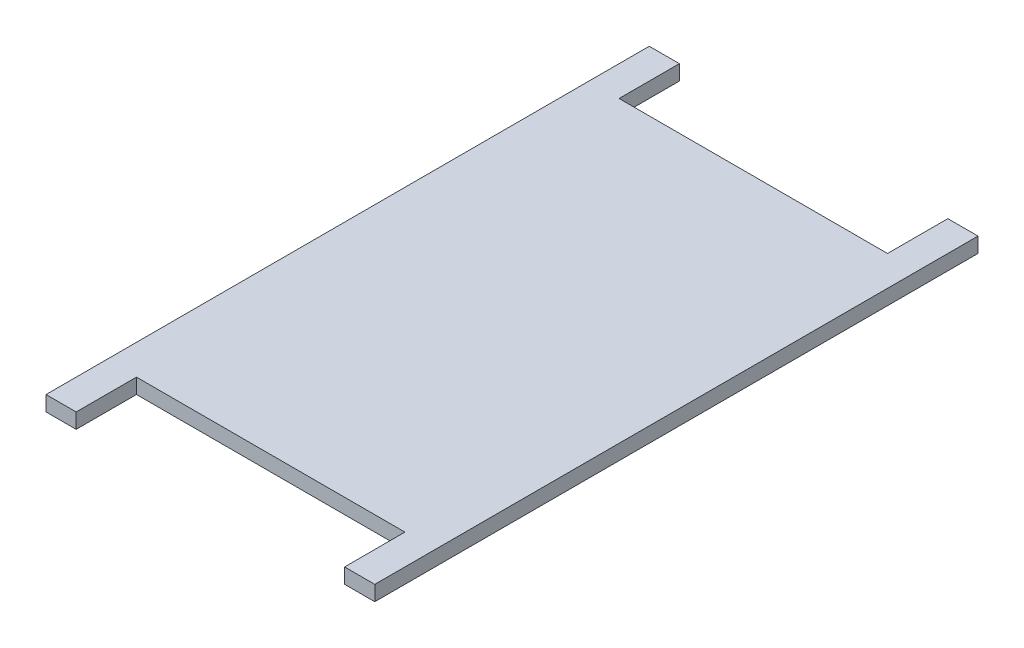
ISO-10303-21;
HEADER;
FILE_DESCRIPTION(('STEP AP214'),'2;1');
FILE_NAME('part.step','',(''),(''),'','','');
FILE_SCHEMA(('AUTOMOTIVE_DESIGN { 1 0 10303 214 1 1 1 1 }'));
ENDSEC;
DATA;
#1=APPLICATION_CONTEXT('core data for automotive mechanical design processes');
#2=APPLICATION_PROTOCOL_DEFINITION('international standard','automotive_design',2000,#1);
#3=PRODUCT_CONTEXT('',#1,'mechanical');
#4=PRODUCT('Part','Part','',(#3));
#5=PRODUCT_RELATED_PRODUCT_CATEGORY('part','',(#4));
#6=PRODUCT_DEFINITION_FORMATION('','',#4);
#7=PRODUCT_DEFINITION_CONTEXT('part definition',#1,'design');
#8=PRODUCT_DEFINITION('design','',#6,#7);
#9=PRODUCT_DEFINITION_SHAPE('','',#8);
#10=(LENGTH_UNIT() NAMED_UNIT(*) SI_UNIT(.MILLI.,.METRE.));
#11=(NAMED_UNIT(*) PLANE_ANGLE_UNIT() SI_UNIT($,.RADIAN.));
#12=(NAMED_UNIT(*) SI_UNIT($,.STERADIAN.) SOLID_ANGLE_UNIT());
#13=UNCERTAINTY_MEASURE_WITH_UNIT(LENGTH_MEASURE(1.E-05),#10,'distance_accuracy_value','');
#14=(GEOMETRIC_REPRESENTATION_CONTEXT(3) GLOBAL_UNCERTAINTY_ASSIGNED_CONTEXT((#13)) GLOBAL_UNIT_ASSIGNED_CONTEXT((#10,
#11,#12)) REPRESENTATION_CONTEXT('',''));
#15=CARTESIAN_POINT('',(0.,0.,0.));
#16=DIRECTION('',(0.,0.,1.));
#17=DIRECTION('',(1.,0.,0.));
#18=AXIS2_PLACEMENT_3D('',#15,#16,#17);
#19=CARTESIAN_POINT('',(-1.09,0.1,1.6));
#20=DIRECTION('',(0.,0.,1.));
#21=DIRECTION('',(1.,0.,0.));
#22=AXIS2_PLACEMENT_3D('',#19,#20,#21);
#23=PLANE('',#22);
#24=DIRECTION('',(1.,0.,0.));
#25=VECTOR('',#24,1.);
#26=CARTESIAN_POINT('',(-0.89,0.2,1.6));
#27=LINE('',#26,#25);
#28=CARTESIAN_POINT('',(-0.89,0.2,1.6));
#29=VERTEX_POINT('',#28);
#30=CARTESIAN_POINT('',(0.89,0.2,1.6));
#31=VERTEX_POINT('',#30);
#32=EDGE_CURVE('E11',#29,#31,#27,.T.);
#33=ORIENTED_EDGE('',*,*,#32,.F.);
#34=DIRECTION('',(0.,1.,0.));
#35=VECTOR('',#34,1.);
#36=CARTESIAN_POINT('',(-0.89,0.1,1.6));
#37=LINE('',#36,#35);
#38=CARTESIAN_POINT('',(-0.89,0.1,1.6));
#39=VERTEX_POINT('',#38);
#40=EDGE_CURVE('E155',#39,#29,#37,.T.);
#41=ORIENTED_EDGE('',*,*,#40,.F.);
#42=DIRECTION('',(1.,0.,0.));
#43=VECTOR('',#42,1.);
#44=CARTESIAN_POINT('',(-0.89,0.1,1.6));
#45=LINE('',#44,#43);
#46=CARTESIAN_POINT('',(0.89,0.1,1.6));
#47=VERTEX_POINT('',#46);
#48=EDGE_CURVE('E259',#39,#47,#45,.T.);
#49=ORIENTED_EDGE('',*,*,#48,.T.);
#50=DIRECTION('',(0.,1.,0.));
#51=VECTOR('',#50,1.);
#52=CARTESIAN_POINT('',(0.89,0.1,1.6));
#53=LINE('',#52,#51);
#54=EDGE_CURVE('E251',#47,#31,#53,.T.);
#55=ORIENTED_EDGE('',*,*,#54,.T.);
#56=EDGE_LOOP('',(#33,#41,#49,#55));
#57=FACE_BOUND('',#56,.T.);
#58=ADVANCED_FACE('F17',(#57),#23,.T.);
#59=CARTESIAN_POINT('',(0.89,0.1,1.6));
#60=DIRECTION('',(-1.,0.,0.));
#61=DIRECTION('',(0.,0.,1.));
#62=AXIS2_PLACEMENT_3D('',#59,#60,#61);
#63=PLANE('',#62);
#64=DIRECTION('',(0.,1.,0.));
#65=VECTOR('',#64,1.);
#66=CARTESIAN_POINT('',(0.89,0.1,2.));
#67=LINE('',#66,#65);
#68=CARTESIAN_POINT('',(0.89,0.1,2.));
#69=VERTEX_POINT('',#68);
#70=CARTESIAN_POINT('',(0.89,0.2,2.));
#71=VERTEX_POINT('',#70);
#72=EDGE_CURVE('E24',#69,#71,#67,.T.);
#73=ORIENTED_EDGE('',*,*,#72,.T.);
#74=DIRECTION('',(0.,0.,1.));
#75=VECTOR('',#74,1.);
#76=CARTESIAN_POINT('',(0.89,0.2,1.6));
#77=LINE('',#76,#75);
#78=EDGE_CURVE('E261',#31,#71,#77,.T.);
#79=ORIENTED_EDGE('',*,*,#78,.F.);
#80=ORIENTED_EDGE('',*,*,#54,.F.);
#81=DIRECTION('',(0.,0.,1.));
#82=VECTOR('',#81,1.);
#83=CARTESIAN_POINT('',(0.89,0.1,1.6));
#84=LINE('',#83,#82);
#85=EDGE_CURVE('E240',#47,#69,#84,.T.);
#86=ORIENTED_EDGE('',*,*,#85,.T.);
#87=EDGE_LOOP('',(#73,#79,#80,#86));
#88=FACE_BOUND('',#87,.T.);
#89=ADVANCED_FACE('F274',(#88),#63,.T.);
#90=CARTESIAN_POINT('',(0.,0.1,0.));
#91=DIRECTION('',(0.,1.,0.));
#92=DIRECTION('',(1.,0.,0.));
#93=AXIS2_PLACEMENT_3D('',#90,#91,#92);
#94=PLANE('',#93);
#95=DIRECTION('',(0.,0.,1.));
#96=VECTOR('',#95,1.);
#97=CARTESIAN_POINT('',(-0.89,0.1,1.6));
#98=LINE('',#97,#96);
#99=CARTESIAN_POINT('',(-0.89,0.1,2.));
#100=VERTEX_POINT('',#99);
#101=EDGE_CURVE('E264',#39,#100,#98,.T.);
#102=ORIENTED_EDGE('',*,*,#101,.T.);
#103=DIRECTION('',(-1.,0.,0.));
#104=VECTOR('',#103,1.);
#105=CARTESIAN_POINT('',(-0.89,0.1,2.));
#106=LINE('',#105,#104);
#107=CARTESIAN_POINT('',(-1.09,0.1,2.));
#108=VERTEX_POINT('',#107);
#109=EDGE_CURVE('E149',#100,#108,#106,.T.);
#110=ORIENTED_EDGE('',*,*,#109,.T.);
#111=DIRECTION('',(0.,0.,-1.));
#112=VECTOR('',#111,1.);
#113=CARTESIAN_POINT('',(-1.09,0.1,2.));
#114=LINE('',#113,#112);
#115=CARTESIAN_POINT('',(-1.09,0.1,-2.));
#116=VERTEX_POINT('',#115);
#117=EDGE_CURVE('E244',#108,#116,#114,.T.);
#118=ORIENTED_EDGE('',*,*,#117,.T.);
#119=DIRECTION('',(-1.,0.,0.));
#120=VECTOR('',#119,1.);
#121=CARTESIAN_POINT('',(-0.89,0.1,-2.));
#122=LINE('',#121,#120);
#123=CARTESIAN_POINT('',(-0.89,0.1,-2.));
#124=VERTEX_POINT('',#123);
#125=EDGE_CURVE('E232',#124,#116,#122,.T.);
#126=ORIENTED_EDGE('',*,*,#125,.F.);
#127=DIRECTION('',(0.,0.,-1.));
#128=VECTOR('',#127,1.);
#129=CARTESIAN_POINT('',(-0.89,0.1,-1.6));
#130=LINE('',#129,#128);
#131=CARTESIAN_POINT('',(-0.89,0.1,-1.6));
#132=VERTEX_POINT('',#131);
#133=EDGE_CURVE('E219',#132,#124,#130,.T.);
#134=ORIENTED_EDGE('',*,*,#133,.F.);
#135=DIRECTION('',(-1.,0.,0.));
#136=VECTOR('',#135,1.);
#137=CARTESIAN_POINT('',(0.89,0.1,-1.6));
#138=LINE('',#137,#136);
#139=CARTESIAN_POINT('',(0.89,0.1,-1.6));
#140=VERTEX_POINT('',#139);
#141=EDGE_CURVE('E208',#140,#132,#138,.T.);
#142=ORIENTED_EDGE('',*,*,#141,.F.);
#143=DIRECTION('',(0.,0.,-1.));
#144=VECTOR('',#143,1.);
#145=CARTESIAN_POINT('',(0.89,0.1,-1.6));
#146=LINE('',#145,#144);
#147=CARTESIAN_POINT('',(0.89,0.1,-2.));
#148=VERTEX_POINT('',#147);
#149=EDGE_CURVE('E203',#140,#148,#146,.T.);
#150=ORIENTED_EDGE('',*,*,#149,.T.);
#151=DIRECTION('',(1.,0.,0.));
#152=VECTOR('',#151,1.);
#153=CARTESIAN_POINT('',(0.89,0.1,-2.));
#154=LINE('',#153,#152);
#155=CARTESIAN_POINT('',(1.09,0.1,-2.));
#156=VERTEX_POINT('',#155);
#157=EDGE_CURVE('E199',#148,#156,#154,.T.);
#158=ORIENTED_EDGE('',*,*,#157,.T.);
#159=DIRECTION('',(0.,0.,1.));
#160=VECTOR('',#159,1.);
#161=CARTESIAN_POINT('',(1.09,0.1,-2.));
#162=LINE('',#161,#160);
#163=CARTESIAN_POINT('',(1.09,0.1,2.));
#164=VERTEX_POINT('',#163);
#165=EDGE_CURVE('E191',#156,#164,#162,.T.);
#166=ORIENTED_EDGE('',*,*,#165,.T.);
#167=DIRECTION('',(1.,0.,0.));
#168=VECTOR('',#167,1.);
#169=CARTESIAN_POINT('',(0.89,0.1,2.));
#170=LINE('',#169,#168);
#171=EDGE_CURVE('E183',#69,#164,#170,.T.);
#172=ORIENTED_EDGE('',*,*,#171,.F.);
#173=ORIENTED_EDGE('',*,*,#85,.F.);
#174=ORIENTED_EDGE('',*,*,#48,.F.);
#175=EDGE_LOOP('',(#102,#110,#118,#126,#134,#142,#150,#158,#166,#172,#173,#174));
#176=FACE_BOUND('',#175,.T.);
#177=DIRECTION('',(0.707106781186548,0.,-0.707106781186547));
#178=VECTOR('',#177,1.);
#179=CARTESIAN_POINT('',(-0.99,0.1,-1.2));
#180=LINE('',#179,#178);
#181=CARTESIAN_POINT('',(-0.99,0.1,-1.2));
#182=VERTEX_POINT('',#181);
#183=CARTESIAN_POINT('',(-0.69,0.1,-1.5));
#184=VERTEX_POINT('',#183);
#185=EDGE_CURVE('E253',#182,#184,#180,.T.);
#186=ORIENTED_EDGE('',*,*,#185,.F.);
#187=DIRECTION('',(0.,0.,1.));
#188=VECTOR('',#187,1.);
#189=CARTESIAN_POINT('',(-0.99,0.1,-1.2));
#190=LINE('',#189,#188);
#191=CARTESIAN_POINT('',(-0.99,0.1,1.5));
#192=VERTEX_POINT('',#191);
#193=EDGE_CURVE('E242',#182,#192,#190,.T.);
#194=ORIENTED_EDGE('',*,*,#193,.T.);
#195=DIRECTION('',(1.,0.,0.));
#196=VECTOR('',#195,1.);
#197=CARTESIAN_POINT('',(-0.99,0.1,1.5));
#198=LINE('',#197,#196);
#199=CARTESIAN_POINT('',(0.99,0.1,1.5));
#200=VERTEX_POINT('',#199);
#201=EDGE_CURVE('E230',#192,#200,#198,.T.);
#202=ORIENTED_EDGE('',*,*,#201,.T.);
#203=DIRECTION('',(0.,0.,-1.));
#204=VECTOR('',#203,1.);
#205=CARTESIAN_POINT('',(0.99,0.1,1.5));
#206=LINE('',#205,#204);
#207=CARTESIAN_POINT('',(0.99,0.1,-1.5));
#208=VERTEX_POINT('',#207);
#209=EDGE_CURVE('E216',#200,#208,#206,.T.);
#210=ORIENTED_EDGE('',*,*,#209,.T.);
#211=DIRECTION('',(-1.,0.,0.));
#212=VECTOR('',#211,1.);
#213=CARTESIAN_POINT('',(0.99,0.1,-1.5));
#214=LINE('',#213,#212);
#215=EDGE_CURVE('E222',#208,#184,#214,.T.);
#216=ORIENTED_EDGE('',*,*,#215,.T.);
#217=EDGE_LOOP('',(#186,#194,#202,#210,#216));
#218=FACE_BOUND('',#217,.T.);
#219=ADVANCED_FACE('F268',(#176,#218),#94,.F.);
#220=CARTESIAN_POINT('',(0.99,0.,-1.5));
#221=DIRECTION('',(0.,0.,-1.));
#222=DIRECTION('',(-1.,0.,0.));
#223=AXIS2_PLACEMENT_3D('',#220,#221,#222);
#224=PLANE('',#223);
#225=DIRECTION('',(0.,-1.,0.));
#226=VECTOR('',#225,1.);
#227=CARTESIAN_POINT('',(0.99,0.1,-1.5));
#228=LINE('',#227,#226);
#229=CARTESIAN_POINT('',(0.99,0.,-1.5));
#230=VERTEX_POINT('',#229);
#231=EDGE_CURVE('E257',#208,#230,#228,.T.);
#232=ORIENTED_EDGE('',*,*,#231,.T.);
#233=DIRECTION('',(1.,0.,0.));
#234=VECTOR('',#233,1.);
#235=CARTESIAN_POINT('',(-0.69,0.,-1.5));
#236=LINE('',#235,#234);
#237=CARTESIAN_POINT('',(-0.69,0.,-1.5));
#238=VERTEX_POINT('',#237);
#239=EDGE_CURVE('E246',#238,#230,#236,.T.);
#240=ORIENTED_EDGE('',*,*,#239,.F.);
#241=DIRECTION('',(0.,-1.,0.));
#242=VECTOR('',#241,1.);
#243=CARTESIAN_POINT('',(-0.69,0.1,-1.5));
#244=LINE('',#243,#242);
#245=EDGE_CURVE('E249',#184,#238,#244,.T.);
#246=ORIENTED_EDGE('',*,*,#245,.F.);
#247=ORIENTED_EDGE('',*,*,#215,.F.);
#248=EDGE_LOOP('',(#232,#240,#246,#247));
#249=FACE_BOUND('',#248,.T.);
#250=ADVANCED_FACE('F323',(#249),#224,.T.);
#251=CARTESIAN_POINT('',(-0.84,0.1,-1.35));
#252=DIRECTION('',(-0.707106781186548,0.,-0.707106781186548));
#253=DIRECTION('',(0.707106781186548,0.,-0.707106781186548));
#254=AXIS2_PLACEMENT_3D('',#251,#252,#253);
#255=PLANE('',#254);
#256=ORIENTED_EDGE('',*,*,#245,.T.);
#257=DIRECTION('',(0.707106781186548,0.,-0.707106781186547));
#258=VECTOR('',#257,1.);
#259=CARTESIAN_POINT('',(-0.99,0.,-1.2));
#260=LINE('',#259,#258);
#261=CARTESIAN_POINT('',(-0.99,0.,-1.2));
#262=VERTEX_POINT('',#261);
#263=EDGE_CURVE('E235',#262,#238,#260,.T.);
#264=ORIENTED_EDGE('',*,*,#263,.F.);
#265=DIRECTION('',(0.,-1.,0.));
#266=VECTOR('',#265,1.);
#267=CARTESIAN_POINT('',(-0.99,0.1,-1.2));
#268=LINE('',#267,#266);
#269=EDGE_CURVE('E238',#182,#262,#268,.T.);
#270=ORIENTED_EDGE('',*,*,#269,.F.);
#271=ORIENTED_EDGE('',*,*,#185,.T.);
#272=EDGE_LOOP('',(#256,#264,#270,#271));
#273=FACE_BOUND('',#272,.T.);
#274=ADVANCED_FACE('F335',(#273),#255,.T.);
#275=CARTESIAN_POINT('',(-0.99,0.,-1.5));
#276=DIRECTION('',(-1.,0.,0.));
#277=DIRECTION('',(0.,0.,1.));
#278=AXIS2_PLACEMENT_3D('',#275,#276,#277);
#279=PLANE('',#278);
#280=ORIENTED_EDGE('',*,*,#269,.T.);
#281=DIRECTION('',(0.,0.,-1.));
#282=VECTOR('',#281,1.);
#283=CARTESIAN_POINT('',(-0.99,0.,1.5));
#284=LINE('',#283,#282);
#285=CARTESIAN_POINT('',(-0.99,0.,1.5));
#286=VERTEX_POINT('',#285);
#287=EDGE_CURVE('E225',#286,#262,#284,.T.);
#288=ORIENTED_EDGE('',*,*,#287,.F.);
#289=DIRECTION('',(0.,-1.,0.));
#290=VECTOR('',#289,1.);
#291=CARTESIAN_POINT('',(-0.99,0.1,1.5));
#292=LINE('',#291,#290);
#293=EDGE_CURVE('E228',#192,#286,#292,.T.);
#294=ORIENTED_EDGE('',*,*,#293,.F.);
#295=ORIENTED_EDGE('',*,*,#193,.F.);
#296=EDGE_LOOP('',(#280,#288,#294,#295));
#297=FACE_BOUND('',#296,.T.);
#298=ADVANCED_FACE('F339',(#297),#279,.T.);
#299=CARTESIAN_POINT('',(-0.99,0.,1.5));
#300=DIRECTION('',(0.,0.,1.));
#301=DIRECTION('',(1.,0.,0.));
#302=AXIS2_PLACEMENT_3D('',#299,#300,#301);
#303=PLANE('',#302);
#304=ORIENTED_EDGE('',*,*,#293,.T.);
#305=DIRECTION('',(-1.,0.,0.));
#306=VECTOR('',#305,1.);
#307=CARTESIAN_POINT('',(0.99,0.,1.5));
#308=LINE('',#307,#306);
#309=CARTESIAN_POINT('',(0.99,0.,1.5));
#310=VERTEX_POINT('',#309);
#311=EDGE_CURVE('E211',#310,#286,#308,.T.);
#312=ORIENTED_EDGE('',*,*,#311,.F.);
#313=DIRECTION('',(0.,-1.,0.));
#314=VECTOR('',#313,1.);
#315=CARTESIAN_POINT('',(0.99,0.1,1.5));
#316=LINE('',#315,#314);
#317=EDGE_CURVE('E214',#200,#310,#316,.T.);
#318=ORIENTED_EDGE('',*,*,#317,.F.);
#319=ORIENTED_EDGE('',*,*,#201,.F.);
#320=EDGE_LOOP('',(#304,#312,#318,#319));
#321=FACE_BOUND('',#320,.T.);
#322=ADVANCED_FACE('F343',(#321),#303,.T.);
#323=CARTESIAN_POINT('',(0.99,0.,1.5));
#324=DIRECTION('',(1.,0.,0.));
#325=DIRECTION('',(0.,0.,-1.));
#326=AXIS2_PLACEMENT_3D('',#323,#324,#325);
#327=PLANE('',#326);
#328=ORIENTED_EDGE('',*,*,#317,.T.);
#329=DIRECTION('',(0.,0.,1.));
#330=VECTOR('',#329,1.);
#331=CARTESIAN_POINT('',(0.99,0.,-1.5));
#332=LINE('',#331,#330);
#333=EDGE_CURVE('E205',#230,#310,#332,.T.);
#334=ORIENTED_EDGE('',*,*,#333,.F.);
#335=ORIENTED_EDGE('',*,*,#231,.F.);
#336=ORIENTED_EDGE('',*,*,#209,.F.);
#337=EDGE_LOOP('',(#328,#334,#335,#336));
#338=FACE_BOUND('',#337,.T.);
#339=ADVANCED_FACE('F341',(#338),#327,.T.);
#340=CARTESIAN_POINT('',(0.,0.,0.));
#341=DIRECTION('',(0.,1.,0.));
#342=DIRECTION('',(1.,0.,0.));
#343=AXIS2_PLACEMENT_3D('',#340,#341,#342);
#344=PLANE('',#343);
#345=ORIENTED_EDGE('',*,*,#333,.T.);
#346=ORIENTED_EDGE('',*,*,#311,.T.);
#347=ORIENTED_EDGE('',*,*,#287,.T.);
#348=ORIENTED_EDGE('',*,*,#263,.T.);
#349=ORIENTED_EDGE('',*,*,#239,.T.);
#350=EDGE_LOOP('',(#345,#346,#347,#348,#349));
#351=FACE_BOUND('',#350,.T.);
#352=ADVANCED_FACE('F330',(#351),#344,.F.);
#353=CARTESIAN_POINT('',(0.89,0.1,2.));
#354=DIRECTION('',(0.,0.,1.));
#355=DIRECTION('',(1.,0.,0.));
#356=AXIS2_PLACEMENT_3D('',#353,#354,#355);
#357=PLANE('',#356);
#358=DIRECTION('',(0.,1.,0.));
#359=VECTOR('',#358,1.);
#360=CARTESIAN_POINT('',(1.09,0.1,2.));
#361=LINE('',#360,#359);
#362=CARTESIAN_POINT('',(1.09,0.2,2.));
#363=VERTEX_POINT('',#362);
#364=EDGE_CURVE('E201',#164,#363,#361,.T.);
#365=ORIENTED_EDGE('',*,*,#364,.T.);
#366=DIRECTION('',(1.,0.,0.));
#367=VECTOR('',#366,1.);
#368=CARTESIAN_POINT('',(0.89,0.2,2.));
#369=LINE('',#368,#367);
#370=EDGE_CURVE('E193',#71,#363,#369,.T.);
#371=ORIENTED_EDGE('',*,*,#370,.F.);
#372=ORIENTED_EDGE('',*,*,#72,.F.);
#373=ORIENTED_EDGE('',*,*,#171,.T.);
#374=EDGE_LOOP('',(#365,#371,#372,#373));
#375=FACE_BOUND('',#374,.T.);
#376=ADVANCED_FACE('F277',(#375),#357,.T.);
#377=CARTESIAN_POINT('',(0.,0.2,0.));
#378=DIRECTION('',(0.,1.,0.));
#379=DIRECTION('',(1.,0.,0.));
#380=AXIS2_PLACEMENT_3D('',#377,#378,#379);
#381=PLANE('',#380);
#382=DIRECTION('',(1.,0.,0.));
#383=VECTOR('',#382,1.);
#384=CARTESIAN_POINT('',(0.89,0.2,-2.));
#385=LINE('',#384,#383);
#386=CARTESIAN_POINT('',(0.89,0.2,-2.));
#387=VERTEX_POINT('',#386);
#388=CARTESIAN_POINT('',(1.09,0.2,-2.));
#389=VERTEX_POINT('',#388);
#390=EDGE_CURVE('E196',#387,#389,#385,.T.);
#391=ORIENTED_EDGE('',*,*,#390,.F.);
#392=DIRECTION('',(0.,0.,-1.));
#393=VECTOR('',#392,1.);
#394=CARTESIAN_POINT('',(0.89,0.2,-1.6));
#395=LINE('',#394,#393);
#396=CARTESIAN_POINT('',(0.89,0.2,-1.6));
#397=VERTEX_POINT('',#396);
#398=EDGE_CURVE('E186',#397,#387,#395,.T.);
#399=ORIENTED_EDGE('',*,*,#398,.F.);
#400=DIRECTION('',(-1.,0.,0.));
#401=VECTOR('',#400,1.);
#402=CARTESIAN_POINT('',(0.89,0.2,-1.6));
#403=LINE('',#402,#401);
#404=CARTESIAN_POINT('',(-0.89,0.2,-1.6));
#405=VERTEX_POINT('',#404);
#406=EDGE_CURVE('E175',#397,#405,#403,.T.);
#407=ORIENTED_EDGE('',*,*,#406,.T.);
#408=DIRECTION('',(0.,0.,-1.));
#409=VECTOR('',#408,1.);
#410=CARTESIAN_POINT('',(-0.89,0.2,-1.6));
#411=LINE('',#410,#409);
#412=CARTESIAN_POINT('',(-0.89,0.2,-2.));
#413=VERTEX_POINT('',#412);
#414=EDGE_CURVE('E170',#405,#413,#411,.T.);
#415=ORIENTED_EDGE('',*,*,#414,.T.);
#416=DIRECTION('',(-1.,0.,0.));
#417=VECTOR('',#416,1.);
#418=CARTESIAN_POINT('',(-0.89,0.2,-2.));
#419=LINE('',#418,#417);
#420=CARTESIAN_POINT('',(-1.09,0.2,-2.));
#421=VERTEX_POINT('',#420);
#422=EDGE_CURVE('E168',#413,#421,#419,.T.);
#423=ORIENTED_EDGE('',*,*,#422,.T.);
#424=DIRECTION('',(0.,0.,-1.));
#425=VECTOR('',#424,1.);
#426=CARTESIAN_POINT('',(-1.09,0.2,2.));
#427=LINE('',#426,#425);
#428=CARTESIAN_POINT('',(-1.09,0.2,2.));
#429=VERTEX_POINT('',#428);
#430=EDGE_CURVE('E139',#429,#421,#427,.T.);
#431=ORIENTED_EDGE('',*,*,#430,.F.);
#432=DIRECTION('',(-1.,0.,0.));
#433=VECTOR('',#432,1.);
#434=CARTESIAN_POINT('',(-0.89,0.2,2.));
#435=LINE('',#434,#433);
#436=CARTESIAN_POINT('',(-0.89,0.2,2.));
#437=VERTEX_POINT('',#436);
#438=EDGE_CURVE('E132',#437,#429,#435,.T.);
#439=ORIENTED_EDGE('',*,*,#438,.F.);
#440=DIRECTION('',(0.,0.,1.));
#441=VECTOR('',#440,1.);
#442=CARTESIAN_POINT('',(-0.89,0.2,1.6));
#443=LINE('',#442,#441);
#444=EDGE_CURVE('E136',#29,#437,#443,.T.);
#445=ORIENTED_EDGE('',*,*,#444,.F.);
#446=ORIENTED_EDGE('',*,*,#32,.T.);
#447=ORIENTED_EDGE('',*,*,#78,.T.);
#448=ORIENTED_EDGE('',*,*,#370,.T.);
#449=DIRECTION('',(0.,0.,1.));
#450=VECTOR('',#449,1.);
#451=CARTESIAN_POINT('',(1.09,0.2,-2.));
#452=LINE('',#451,#450);
#453=EDGE_CURVE('E177',#389,#363,#452,.T.);
#454=ORIENTED_EDGE('',*,*,#453,.F.);
#455=EDGE_LOOP('',(#391,#399,#407,#415,#423,#431,#439,#445,#446,#447,#448,#454));
#456=FACE_BOUND('',#455,.T.);
#457=ADVANCED_FACE('F134',(#456),#381,.T.);
#458=CARTESIAN_POINT('',(1.09,0.1,1.6));
#459=DIRECTION('',(1.,0.,0.));
#460=DIRECTION('',(0.,0.,-1.));
#461=AXIS2_PLACEMENT_3D('',#458,#459,#460);
#462=PLANE('',#461);
#463=DIRECTION('',(0.,1.,0.));
#464=VECTOR('',#463,1.);
#465=CARTESIAN_POINT('',(1.09,0.1,-2.));
#466=LINE('',#465,#464);
#467=EDGE_CURVE('E189',#156,#389,#466,.T.);
#468=ORIENTED_EDGE('',*,*,#467,.T.);
#469=ORIENTED_EDGE('',*,*,#453,.T.);
#470=ORIENTED_EDGE('',*,*,#364,.F.);
#471=ORIENTED_EDGE('',*,*,#165,.F.);
#472=EDGE_LOOP('',(#468,#469,#470,#471));
#473=FACE_BOUND('',#472,.T.);
#474=ADVANCED_FACE('F281',(#473),#462,.T.);
#475=CARTESIAN_POINT('',(0.89,0.1,-2.));
#476=DIRECTION('',(0.,0.,1.));
#477=DIRECTION('',(1.,0.,0.));
#478=AXIS2_PLACEMENT_3D('',#475,#476,#477);
#479=PLANE('',#478);
#480=DIRECTION('',(0.,1.,0.));
#481=VECTOR('',#480,1.);
#482=CARTESIAN_POINT('',(0.89,0.1,-2.));
#483=LINE('',#482,#481);
#484=EDGE_CURVE('E180',#148,#387,#483,.T.);
#485=ORIENTED_EDGE('',*,*,#484,.T.);
#486=ORIENTED_EDGE('',*,*,#390,.T.);
#487=ORIENTED_EDGE('',*,*,#467,.F.);
#488=ORIENTED_EDGE('',*,*,#157,.F.);
#489=EDGE_LOOP('',(#485,#486,#487,#488));
#490=FACE_BOUND('',#489,.T.);
#491=ADVANCED_FACE('F285',(#490),#479,.F.);
#492=CARTESIAN_POINT('',(0.89,0.1,-1.6));
#493=DIRECTION('',(1.,0.,0.));
#494=DIRECTION('',(0.,0.,-1.));
#495=AXIS2_PLACEMENT_3D('',#492,#493,#494);
#496=PLANE('',#495);
#497=DIRECTION('',(0.,1.,0.));
#498=VECTOR('',#497,1.);
#499=CARTESIAN_POINT('',(0.89,0.1,-1.6));
#500=LINE('',#499,#498);
#501=EDGE_CURVE('E172',#140,#397,#500,.T.);
#502=ORIENTED_EDGE('',*,*,#501,.T.);
#503=ORIENTED_EDGE('',*,*,#398,.T.);
#504=ORIENTED_EDGE('',*,*,#484,.F.);
#505=ORIENTED_EDGE('',*,*,#149,.F.);
#506=EDGE_LOOP('',(#502,#503,#504,#505));
#507=FACE_BOUND('',#506,.T.);
#508=ADVANCED_FACE('F291',(#507),#496,.F.);
#509=CARTESIAN_POINT('',(1.09,0.1,-1.6));
#510=DIRECTION('',(0.,0.,-1.));
#511=DIRECTION('',(-1.,0.,0.));
#512=AXIS2_PLACEMENT_3D('',#509,#510,#511);
#513=PLANE('',#512);
#514=ORIENTED_EDGE('',*,*,#141,.T.);
#515=DIRECTION('',(0.,1.,0.));
#516=VECTOR('',#515,1.);
#517=CARTESIAN_POINT('',(-0.89,0.1,-1.6));
#518=LINE('',#517,#516);
#519=EDGE_CURVE('E165',#132,#405,#518,.T.);
#520=ORIENTED_EDGE('',*,*,#519,.T.);
#521=ORIENTED_EDGE('',*,*,#406,.F.);
#522=ORIENTED_EDGE('',*,*,#501,.F.);
#523=EDGE_LOOP('',(#514,#520,#521,#522));
#524=FACE_BOUND('',#523,.T.);
#525=ADVANCED_FACE('F293',(#524),#513,.T.);
#526=CARTESIAN_POINT('',(-0.89,0.1,-1.6));
#527=DIRECTION('',(1.,0.,0.));
#528=DIRECTION('',(0.,0.,-1.));
#529=AXIS2_PLACEMENT_3D('',#526,#527,#528);
#530=PLANE('',#529);
#531=ORIENTED_EDGE('',*,*,#133,.T.);
#532=DIRECTION('',(0.,1.,0.));
#533=VECTOR('',#532,1.);
#534=CARTESIAN_POINT('',(-0.89,0.1,-2.));
#535=LINE('',#534,#533);
#536=EDGE_CURVE('E143',#124,#413,#535,.T.);
#537=ORIENTED_EDGE('',*,*,#536,.T.);
#538=ORIENTED_EDGE('',*,*,#414,.F.);
#539=ORIENTED_EDGE('',*,*,#519,.F.);
#540=EDGE_LOOP('',(#531,#537,#538,#539));
#541=FACE_BOUND('',#540,.T.);
#542=ADVANCED_FACE('F297',(#541),#530,.T.);
#543=CARTESIAN_POINT('',(-0.89,0.1,-2.));
#544=DIRECTION('',(0.,0.,-1.));
#545=DIRECTION('',(-1.,0.,0.));
#546=AXIS2_PLACEMENT_3D('',#543,#544,#545);
#547=PLANE('',#546);
#548=DIRECTION('',(0.,1.,0.));
#549=VECTOR('',#548,1.);
#550=CARTESIAN_POINT('',(-1.09,0.1,-2.));
#551=LINE('',#550,#549);
#552=EDGE_CURVE('E161',#116,#421,#551,.T.);
#553=ORIENTED_EDGE('',*,*,#552,.T.);
#554=ORIENTED_EDGE('',*,*,#422,.F.);
#555=ORIENTED_EDGE('',*,*,#536,.F.);
#556=ORIENTED_EDGE('',*,*,#125,.T.);
#557=EDGE_LOOP('',(#553,#554,#555,#556));
#558=FACE_BOUND('',#557,.T.);
#559=ADVANCED_FACE('F302',(#558),#547,.T.);
#560=CARTESIAN_POINT('',(-1.09,0.1,-1.6));
#561=DIRECTION('',(-1.,0.,0.));
#562=DIRECTION('',(0.,0.,1.));
#563=AXIS2_PLACEMENT_3D('',#560,#561,#562);
#564=PLANE('',#563);
#565=ORIENTED_EDGE('',*,*,#552,.F.);
#566=ORIENTED_EDGE('',*,*,#117,.F.);
#567=DIRECTION('',(0.,1.,0.));
#568=VECTOR('',#567,1.);
#569=CARTESIAN_POINT('',(-1.09,0.1,2.));
#570=LINE('',#569,#568);
#571=EDGE_CURVE('E152',#108,#429,#570,.T.);
#572=ORIENTED_EDGE('',*,*,#571,.T.);
#573=ORIENTED_EDGE('',*,*,#430,.T.);
#574=EDGE_LOOP('',(#565,#566,#572,#573));
#575=FACE_BOUND('',#574,.T.);
#576=ADVANCED_FACE('F304',(#575),#564,.T.);
#577=CARTESIAN_POINT('',(-0.89,0.1,2.));
#578=DIRECTION('',(0.,0.,-1.));
#579=DIRECTION('',(-1.,0.,0.));
#580=AXIS2_PLACEMENT_3D('',#577,#578,#579);
#581=PLANE('',#580);
#582=DIRECTION('',(0.,1.,0.));
#583=VECTOR('',#582,1.);
#584=CARTESIAN_POINT('',(-0.89,0.1,2.));
#585=LINE('',#584,#583);
#586=EDGE_CURVE('E147',#100,#437,#585,.T.);
#587=ORIENTED_EDGE('',*,*,#586,.T.);
#588=ORIENTED_EDGE('',*,*,#438,.T.);
#589=ORIENTED_EDGE('',*,*,#571,.F.);
#590=ORIENTED_EDGE('',*,*,#109,.F.);
#591=EDGE_LOOP('',(#587,#588,#589,#590));
#592=FACE_BOUND('',#591,.T.);
#593=ADVANCED_FACE('F148',(#592),#581,.F.);
#594=CARTESIAN_POINT('',(-0.89,0.1,1.6));
#595=DIRECTION('',(-1.,0.,0.));
#596=DIRECTION('',(0.,0.,1.));
#597=AXIS2_PLACEMENT_3D('',#594,#595,#596);
#598=PLANE('',#597);
#599=ORIENTED_EDGE('',*,*,#40,.T.);
#600=ORIENTED_EDGE('',*,*,#444,.T.);
#601=ORIENTED_EDGE('',*,*,#586,.F.);
#602=ORIENTED_EDGE('',*,*,#101,.F.);
#603=EDGE_LOOP('',(#599,#600,#601,#602));
#604=FACE_BOUND('',#603,.T.);
#605=ADVANCED_FACE('F154',(#604),#598,.F.);
#606=CLOSED_SHELL('',(#58,#89,#219,#250,#274,#298,#322,#339,#352,#376,#457,#474,#491,#508,#525,
#542,#559,#576,#593,#605));
#607=MANIFOLD_SOLID_BREP('B1',#606);
#608=ADVANCED_BREP_SHAPE_REPRESENTATION('',(#18,#607),#14);
#609=SHAPE_DEFINITION_REPRESENTATION(#9,#608);
ENDSEC;
END-ISO-10303-21;
